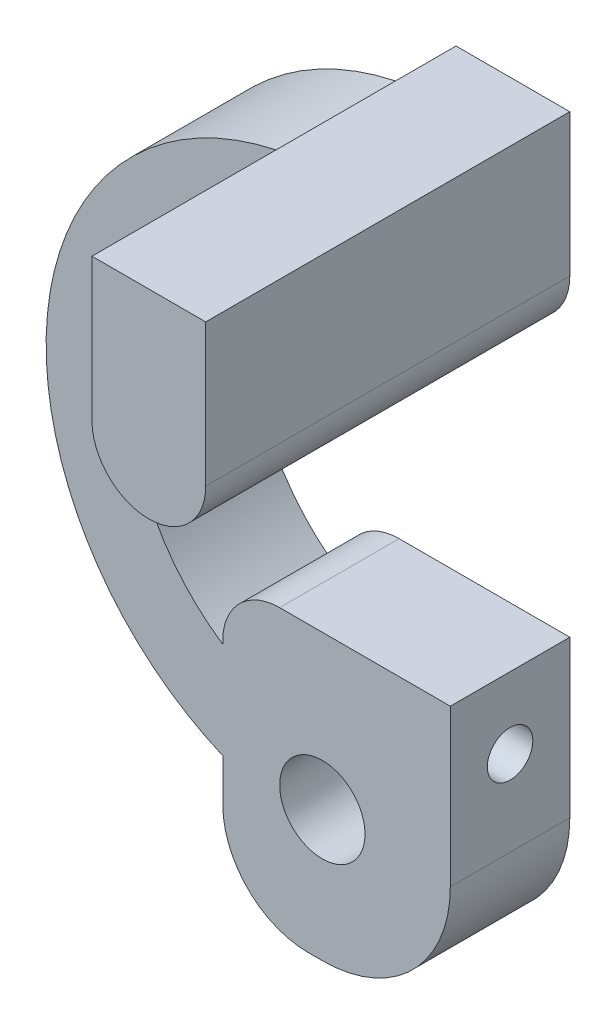
ISO-10303-21;
HEADER;
FILE_DESCRIPTION(('STEP AP214'),'2;1');
FILE_NAME('part.step','',(''),(''),'','','');
FILE_SCHEMA(('AUTOMOTIVE_DESIGN { 1 0 10303 214 1 1 1 1 }'));
ENDSEC;
DATA;
#1=APPLICATION_CONTEXT('core data for automotive mechanical design processes');
#2=APPLICATION_PROTOCOL_DEFINITION('international standard','automotive_design',2000,#1);
#3=PRODUCT_CONTEXT('',#1,'mechanical');
#4=PRODUCT('Part','Part','',(#3));
#5=PRODUCT_RELATED_PRODUCT_CATEGORY('part','',(#4));
#6=PRODUCT_DEFINITION_FORMATION('','',#4);
#7=PRODUCT_DEFINITION_CONTEXT('part definition',#1,'design');
#8=PRODUCT_DEFINITION('design','',#6,#7);
#9=PRODUCT_DEFINITION_SHAPE('','',#8);
#10=(LENGTH_UNIT() NAMED_UNIT(*) SI_UNIT(.MILLI.,.METRE.));
#11=(NAMED_UNIT(*) PLANE_ANGLE_UNIT() SI_UNIT($,.RADIAN.));
#12=(NAMED_UNIT(*) SI_UNIT($,.STERADIAN.) SOLID_ANGLE_UNIT());
#13=UNCERTAINTY_MEASURE_WITH_UNIT(LENGTH_MEASURE(1.E-05),#10,'distance_accuracy_value','');
#14=(GEOMETRIC_REPRESENTATION_CONTEXT(3) GLOBAL_UNCERTAINTY_ASSIGNED_CONTEXT((#13)) GLOBAL_UNIT_ASSIGNED_CONTEXT((#10,
#11,#12)) REPRESENTATION_CONTEXT('',''));
#15=CARTESIAN_POINT('',(0.,0.,0.));
#16=DIRECTION('',(0.,0.,1.));
#17=DIRECTION('',(1.,0.,0.));
#18=AXIS2_PLACEMENT_3D('',#15,#16,#17);
#19=CARTESIAN_POINT('',(0.,0.,4.2));
#20=DIRECTION('',(0.,1.,0.));
#21=DIRECTION('',(0.,0.,1.));
#22=AXIS2_PLACEMENT_3D('',#19,#20,#21);
#23=PLANE('',#22);
#24=DIRECTION('',(1.,0.,0.));
#25=VECTOR('',#24,1.);
#26=CARTESIAN_POINT('',(0.,0.,4.2));
#27=LINE('',#26,#25);
#28=CARTESIAN_POINT('',(3.,0.,4.2));
#29=VERTEX_POINT('',#28);
#30=CARTESIAN_POINT('',(3.5,0.,4.2));
#31=VERTEX_POINT('',#30);
#32=EDGE_CURVE('E177',#29,#31,#27,.T.);
#33=ORIENTED_EDGE('',*,*,#32,.F.);
#34=DIRECTION('',(0.,0.,-1.));
#35=VECTOR('',#34,1.);
#36=CARTESIAN_POINT('',(3.,0.,0.));
#37=LINE('',#36,#35);
#38=CARTESIAN_POINT('',(3.,0.,0.));
#39=VERTEX_POINT('',#38);
#40=EDGE_CURVE('E287',#29,#39,#37,.T.);
#41=ORIENTED_EDGE('',*,*,#40,.T.);
#42=DIRECTION('',(1.,0.,0.));
#43=VECTOR('',#42,1.);
#44=CARTESIAN_POINT('',(0.,0.,0.));
#45=LINE('',#44,#43);
#46=CARTESIAN_POINT('',(3.5,0.,0.));
#47=VERTEX_POINT('',#46);
#48=EDGE_CURVE('E176',#39,#47,#45,.T.);
#49=ORIENTED_EDGE('',*,*,#48,.T.);
#50=DIRECTION('',(0.,0.,-1.));
#51=VECTOR('',#50,1.);
#52=CARTESIAN_POINT('',(3.5,0.,4.2));
#53=LINE('',#52,#51);
#54=EDGE_CURVE('E259',#47,#31,#53,.F.);
#55=ORIENTED_EDGE('',*,*,#54,.T.);
#56=EDGE_LOOP('',(#33,#41,#49,#55));
#57=FACE_BOUND('',#56,.T.);
#58=ADVANCED_FACE('F35',(#57),#23,.F.);
#59=CARTESIAN_POINT('',(8.,0.,4.2));
#60=DIRECTION('',(-1.,0.,0.));
#61=DIRECTION('',(0.,0.,1.));
#62=AXIS2_PLACEMENT_3D('',#59,#60,#61);
#63=PLANE('',#62);
#64=CARTESIAN_POINT('',(8.,7.5,2.1));
#65=DIRECTION('',(1.,0.,0.));
#66=DIRECTION('',(0.,0.,-1.));
#67=AXIS2_PLACEMENT_3D('',#64,#65,#66);
#68=CIRCLE('',#67,0.79999999999999);
#69=CARTESIAN_POINT('',(8.,7.5,1.30000000000001));
#70=VERTEX_POINT('',#69);
#71=EDGE_CURVE('E157',#70,#70,#68,.T.);
#72=ORIENTED_EDGE('',*,*,#71,.F.);
#73=EDGE_LOOP('',(#72));
#74=FACE_BOUND('',#73,.T.);
#75=DIRECTION('',(0.,1.,0.));
#76=VECTOR('',#75,1.);
#77=CARTESIAN_POINT('',(8.,0.,4.2));
#78=LINE('',#77,#76);
#79=CARTESIAN_POINT('',(8.,4.5,4.2));
#80=VERTEX_POINT('',#79);
#81=CARTESIAN_POINT('',(8.,10.,4.2));
#82=VERTEX_POINT('',#81);
#83=EDGE_CURVE('E179',#80,#82,#78,.T.);
#84=ORIENTED_EDGE('',*,*,#83,.F.);
#85=DIRECTION('',(0.,0.,-1.));
#86=VECTOR('',#85,1.);
#87=CARTESIAN_POINT('',(8.,4.5,4.2));
#88=LINE('',#87,#86);
#89=CARTESIAN_POINT('',(8.,4.5,0.));
#90=VERTEX_POINT('',#89);
#91=EDGE_CURVE('E238',#80,#90,#88,.T.);
#92=ORIENTED_EDGE('',*,*,#91,.T.);
#93=DIRECTION('',(0.,1.,0.));
#94=VECTOR('',#93,1.);
#95=CARTESIAN_POINT('',(8.,0.,0.));
#96=LINE('',#95,#94);
#97=CARTESIAN_POINT('',(8.,10.,0.));
#98=VERTEX_POINT('',#97);
#99=EDGE_CURVE('E194',#90,#98,#96,.T.);
#100=ORIENTED_EDGE('',*,*,#99,.T.);
#101=DIRECTION('',(0.,0.,-1.));
#102=VECTOR('',#101,1.);
#103=CARTESIAN_POINT('',(8.,10.,4.2));
#104=LINE('',#103,#102);
#105=EDGE_CURVE('E230',#82,#98,#104,.T.);
#106=ORIENTED_EDGE('',*,*,#105,.F.);
#107=EDGE_LOOP('',(#84,#92,#100,#106));
#108=FACE_BOUND('',#107,.T.);
#109=ADVANCED_FACE('F309',(#74,#108),#63,.F.);
#110=CARTESIAN_POINT('',(0.,10.,4.2));
#111=DIRECTION('',(0.,-1.,0.));
#112=DIRECTION('',(1.,0.,0.));
#113=AXIS2_PLACEMENT_3D('',#110,#111,#112);
#114=PLANE('',#113);
#115=DIRECTION('',(-1.,0.,0.));
#116=VECTOR('',#115,1.);
#117=CARTESIAN_POINT('',(0.,10.,0.));
#118=LINE('',#117,#116);
#119=CARTESIAN_POINT('',(2.,10.,0.));
#120=VERTEX_POINT('',#119);
#121=EDGE_CURVE('E196',#98,#120,#118,.T.);
#122=ORIENTED_EDGE('',*,*,#121,.T.);
#123=DIRECTION('',(0.,0.,-1.));
#124=VECTOR('',#123,1.);
#125=CARTESIAN_POINT('',(2.,10.,4.2));
#126=LINE('',#125,#124);
#127=CARTESIAN_POINT('',(2.,10.,4.2));
#128=VERTEX_POINT('',#127);
#129=EDGE_CURVE('E271',#120,#128,#126,.F.);
#130=ORIENTED_EDGE('',*,*,#129,.T.);
#131=DIRECTION('',(-1.,0.,0.));
#132=VECTOR('',#131,1.);
#133=CARTESIAN_POINT('',(0.,10.,4.2));
#134=LINE('',#133,#132);
#135=EDGE_CURVE('E182',#82,#128,#134,.T.);
#136=ORIENTED_EDGE('',*,*,#135,.F.);
#137=ORIENTED_EDGE('',*,*,#105,.T.);
#138=EDGE_LOOP('',(#122,#130,#136,#137));
#139=FACE_BOUND('',#138,.T.);
#140=ADVANCED_FACE('F312',(#139),#114,.F.);
#141=CARTESIAN_POINT('',(0.,0.,4.2));
#142=DIRECTION('',(-1.,0.,0.));
#143=DIRECTION('',(0.,0.,1.));
#144=AXIS2_PLACEMENT_3D('',#141,#142,#143);
#145=PLANE('',#144);
#146=DIRECTION('',(0.,1.,0.));
#147=VECTOR('',#146,1.);
#148=CARTESIAN_POINT('',(0.,0.,4.2));
#149=LINE('',#148,#147);
#150=CARTESIAN_POINT('',(0.,7.88504763568032,4.2));
#151=VERTEX_POINT('',#150);
#152=CARTESIAN_POINT('',(0.,8.,4.2));
#153=VERTEX_POINT('',#152);
#154=EDGE_CURVE('E185',#151,#153,#149,.T.);
#155=ORIENTED_EDGE('',*,*,#154,.T.);
#156=DIRECTION('',(0.,0.,-1.));
#157=VECTOR('',#156,1.);
#158=CARTESIAN_POINT('',(0.,8.,0.));
#159=LINE('',#158,#157);
#160=CARTESIAN_POINT('',(0.,8.,0.));
#161=VERTEX_POINT('',#160);
#162=EDGE_CURVE('E264',#153,#161,#159,.T.);
#163=ORIENTED_EDGE('',*,*,#162,.T.);
#164=DIRECTION('',(0.,1.,0.));
#165=VECTOR('',#164,1.);
#166=CARTESIAN_POINT('',(0.,0.,0.));
#167=LINE('',#166,#165);
#168=CARTESIAN_POINT('',(0.,7.88504763568032,0.));
#169=VERTEX_POINT('',#168);
#170=EDGE_CURVE('E199',#169,#161,#167,.T.);
#171=ORIENTED_EDGE('',*,*,#170,.F.);
#172=DIRECTION('',(0.,0.,-1.));
#173=VECTOR('',#172,1.);
#174=CARTESIAN_POINT('',(0.,7.88504763568032,4.2));
#175=LINE('',#174,#173);
#176=EDGE_CURVE('E228',#151,#169,#175,.T.);
#177=ORIENTED_EDGE('',*,*,#176,.F.);
#178=EDGE_LOOP('',(#155,#163,#171,#177));
#179=FACE_BOUND('',#178,.T.);
#180=ADVANCED_FACE('F321',(#179),#145,.T.);
#181=CARTESIAN_POINT('',(4.,13.885510766967,4.2));
#182=DIRECTION('',(0.,0.,-1.));
#183=DIRECTION('',(-1.,0.,0.));
#184=AXIS2_PLACEMENT_3D('',#181,#182,#183);
#185=CYLINDRICAL_SURFACE('',#184,7.21148790402723);
#186=CARTESIAN_POINT('',(4.,13.885510766967,0.));
#187=DIRECTION('',(0.,0.,1.));
#188=DIRECTION('',(1.,0.,0.));
#189=AXIS2_PLACEMENT_3D('',#186,#187,#188);
#190=CIRCLE('',#189,7.21148790402723);
#191=CARTESIAN_POINT('',(4.,21.0969986709942,0.));
#192=VERTEX_POINT('',#191);
#193=EDGE_CURVE('E202',#192,#169,#190,.T.);
#194=ORIENTED_EDGE('',*,*,#193,.F.);
#195=DIRECTION('',(0.,0.,-1.));
#196=VECTOR('',#195,1.);
#197=CARTESIAN_POINT('',(4.,21.0969986709942,4.2));
#198=LINE('',#197,#196);
#199=CARTESIAN_POINT('',(4.,21.0969986709942,4.2));
#200=VERTEX_POINT('',#199);
#201=EDGE_CURVE('E227',#200,#192,#198,.T.);
#202=ORIENTED_EDGE('',*,*,#201,.F.);
#203=CARTESIAN_POINT('',(4.,13.885510766967,4.2));
#204=DIRECTION('',(0.,0.,1.));
#205=DIRECTION('',(1.,0.,0.));
#206=AXIS2_PLACEMENT_3D('',#203,#204,#205);
#207=CIRCLE('',#206,7.21148790402723);
#208=EDGE_CURVE('E188',#200,#151,#207,.T.);
#209=ORIENTED_EDGE('',*,*,#208,.T.);
#210=ORIENTED_EDGE('',*,*,#176,.T.);
#211=EDGE_LOOP('',(#194,#202,#209,#210));
#212=FACE_BOUND('',#211,.T.);
#213=ADVANCED_FACE('F325',(#212),#185,.F.);
#214=CARTESIAN_POINT('',(8.,0.,4.2));
#215=DIRECTION('',(-1.,0.,0.));
#216=DIRECTION('',(0.,0.,1.));
#217=AXIS2_PLACEMENT_3D('',#214,#215,#216);
#218=PLANE('',#217);
#219=DIRECTION('',(0.,1.,0.));
#220=VECTOR('',#219,1.);
#221=CARTESIAN_POINT('',(8.,26.,12.8));
#222=LINE('',#221,#220);
#223=CARTESIAN_POINT('',(8.,21.,12.8));
#224=VERTEX_POINT('',#223);
#225=CARTESIAN_POINT('',(8.,26.,12.8));
#226=VERTEX_POINT('',#225);
#227=EDGE_CURVE('E171',#224,#226,#222,.T.);
#228=ORIENTED_EDGE('',*,*,#227,.F.);
#229=DIRECTION('',(0.,0.,-1.));
#230=VECTOR('',#229,1.);
#231=CARTESIAN_POINT('',(8.,21.,0.));
#232=LINE('',#231,#230);
#233=CARTESIAN_POINT('',(8.,21.,0.));
#234=VERTEX_POINT('',#233);
#235=EDGE_CURVE('E275',#224,#234,#232,.T.);
#236=ORIENTED_EDGE('',*,*,#235,.T.);
#237=DIRECTION('',(0.,1.,0.));
#238=VECTOR('',#237,1.);
#239=CARTESIAN_POINT('',(8.,0.,0.));
#240=LINE('',#239,#238);
#241=CARTESIAN_POINT('',(8.,26.,0.));
#242=VERTEX_POINT('',#241);
#243=EDGE_CURVE('E208',#234,#242,#240,.T.);
#244=ORIENTED_EDGE('',*,*,#243,.T.);
#245=DIRECTION('',(0.,0.,-1.));
#246=VECTOR('',#245,1.);
#247=CARTESIAN_POINT('',(8.,26.,4.2));
#248=LINE('',#247,#246);
#249=EDGE_CURVE('E224',#226,#242,#248,.T.);
#250=ORIENTED_EDGE('',*,*,#249,.F.);
#251=EDGE_LOOP('',(#228,#236,#244,#250));
#252=FACE_BOUND('',#251,.T.);
#253=ADVANCED_FACE('F372',(#252),#218,.F.);
#254=CARTESIAN_POINT('',(0.,26.,4.2));
#255=DIRECTION('',(0.,1.,0.));
#256=DIRECTION('',(0.,0.,1.));
#257=AXIS2_PLACEMENT_3D('',#254,#255,#256);
#258=PLANE('',#257);
#259=DIRECTION('',(1.,0.,0.));
#260=VECTOR('',#259,1.);
#261=CARTESIAN_POINT('',(0.,26.,0.));
#262=LINE('',#261,#260);
#263=CARTESIAN_POINT('',(4.,26.,0.));
#264=VERTEX_POINT('',#263);
#265=EDGE_CURVE('E210',#264,#242,#262,.T.);
#266=ORIENTED_EDGE('',*,*,#265,.F.);
#267=DIRECTION('',(0.,0.,-1.));
#268=VECTOR('',#267,1.);
#269=CARTESIAN_POINT('',(4.,26.,4.2));
#270=LINE('',#269,#268);
#271=CARTESIAN_POINT('',(4.,26.,12.8));
#272=VERTEX_POINT('',#271);
#273=EDGE_CURVE('E222',#272,#264,#270,.T.);
#274=ORIENTED_EDGE('',*,*,#273,.F.);
#275=DIRECTION('',(-1.,0.,0.));
#276=VECTOR('',#275,1.);
#277=CARTESIAN_POINT('',(4.,26.,12.8));
#278=LINE('',#277,#276);
#279=EDGE_CURVE('E173',#226,#272,#278,.T.);
#280=ORIENTED_EDGE('',*,*,#279,.F.);
#281=ORIENTED_EDGE('',*,*,#249,.T.);
#282=EDGE_LOOP('',(#266,#274,#280,#281));
#283=FACE_BOUND('',#282,.T.);
#284=ADVANCED_FACE('F377',(#283),#258,.T.);
#285=CARTESIAN_POINT('',(4.00000000000001,0.,4.2));
#286=DIRECTION('',(1.,0.,0.));
#287=DIRECTION('',(0.,1.,0.));
#288=AXIS2_PLACEMENT_3D('',#285,#286,#287);
#289=PLANE('',#288);
#290=DIRECTION('',(0.,-1.,0.));
#291=VECTOR('',#290,1.);
#292=CARTESIAN_POINT('',(4.,0.,0.));
#293=LINE('',#292,#291);
#294=CARTESIAN_POINT('',(4.,21.,0.));
#295=VERTEX_POINT('',#294);
#296=EDGE_CURVE('E205',#192,#295,#293,.T.);
#297=ORIENTED_EDGE('',*,*,#296,.T.);
#298=DIRECTION('',(0.,0.,-1.));
#299=VECTOR('',#298,1.);
#300=CARTESIAN_POINT('',(4.,21.,12.8));
#301=LINE('',#300,#299);
#302=CARTESIAN_POINT('',(4.,21.,12.8));
#303=VERTEX_POINT('',#302);
#304=EDGE_CURVE('E286',#295,#303,#301,.F.);
#305=ORIENTED_EDGE('',*,*,#304,.T.);
#306=DIRECTION('',(0.,-1.,0.));
#307=VECTOR('',#306,1.);
#308=CARTESIAN_POINT('',(4.,26.,12.8));
#309=LINE('',#308,#307);
#310=EDGE_CURVE('E168',#272,#303,#309,.T.);
#311=ORIENTED_EDGE('',*,*,#310,.F.);
#312=ORIENTED_EDGE('',*,*,#273,.T.);
#313=DIRECTION('',(0.,-1.,0.));
#314=VECTOR('',#313,1.);
#315=CARTESIAN_POINT('',(4.00000000000001,0.,0.));
#316=LINE('',#315,#314);
#317=CARTESIAN_POINT('',(4.,24.0969986709942,0.));
#318=VERTEX_POINT('',#317);
#319=EDGE_CURVE('E213',#264,#318,#316,.T.);
#320=ORIENTED_EDGE('',*,*,#319,.T.);
#321=DIRECTION('',(0.,0.,-1.));
#322=VECTOR('',#321,1.);
#323=CARTESIAN_POINT('',(4.,24.0969986709942,4.2));
#324=LINE('',#323,#322);
#325=CARTESIAN_POINT('',(4.,24.0969986709942,4.2));
#326=VERTEX_POINT('',#325);
#327=EDGE_CURVE('E221',#326,#318,#324,.T.);
#328=ORIENTED_EDGE('',*,*,#327,.F.);
#329=DIRECTION('',(0.,-1.,0.));
#330=VECTOR('',#329,1.);
#331=CARTESIAN_POINT('',(4.,26.,4.2));
#332=LINE('',#331,#330);
#333=EDGE_CURVE('E233',#326,#200,#332,.T.);
#334=ORIENTED_EDGE('',*,*,#333,.T.);
#335=ORIENTED_EDGE('',*,*,#201,.T.);
#336=EDGE_LOOP('',(#297,#305,#311,#312,#320,#328,#334,#335));
#337=FACE_BOUND('',#336,.T.);
#338=ADVANCED_FACE('F329',(#337),#289,.F.);
#339=CARTESIAN_POINT('',(4.,13.885510766967,4.2));
#340=DIRECTION('',(0.,0.,-1.));
#341=DIRECTION('',(-1.,0.,0.));
#342=AXIS2_PLACEMENT_3D('',#339,#340,#341);
#343=CYLINDRICAL_SURFACE('',#342,10.2114879040272);
#344=CARTESIAN_POINT('',(4.,13.885510766967,0.));
#345=DIRECTION('',(0.,0.,1.));
#346=DIRECTION('',(1.,0.,0.));
#347=AXIS2_PLACEMENT_3D('',#344,#345,#346);
#348=CIRCLE('',#347,10.2114879040272);
#349=CARTESIAN_POINT('',(0.,4.49006052687238,0.));
#350=VERTEX_POINT('',#349);
#351=EDGE_CURVE('E215',#318,#350,#348,.T.);
#352=ORIENTED_EDGE('',*,*,#351,.T.);
#353=DIRECTION('',(0.,0.,-1.));
#354=VECTOR('',#353,1.);
#355=CARTESIAN_POINT('',(0.,4.49006052687238,4.2));
#356=LINE('',#355,#354);
#357=CARTESIAN_POINT('',(0.,4.49006052687238,4.2));
#358=VERTEX_POINT('',#357);
#359=EDGE_CURVE('E191',#358,#350,#356,.T.);
#360=ORIENTED_EDGE('',*,*,#359,.F.);
#361=CARTESIAN_POINT('',(4.,13.885510766967,4.2));
#362=DIRECTION('',(0.,0.,1.));
#363=DIRECTION('',(1.,0.,0.));
#364=AXIS2_PLACEMENT_3D('',#361,#362,#363);
#365=CIRCLE('',#364,10.2114879040272);
#366=EDGE_CURVE('E192',#326,#358,#365,.T.);
#367=ORIENTED_EDGE('',*,*,#366,.F.);
#368=ORIENTED_EDGE('',*,*,#327,.T.);
#369=EDGE_LOOP('',(#352,#360,#367,#368));
#370=FACE_BOUND('',#369,.T.);
#371=ADVANCED_FACE('F335',(#370),#343,.T.);
#372=CARTESIAN_POINT('',(0.,0.,4.2));
#373=DIRECTION('',(-1.,0.,0.));
#374=DIRECTION('',(0.,0.,1.));
#375=AXIS2_PLACEMENT_3D('',#372,#373,#374);
#376=PLANE('',#375);
#377=DIRECTION('',(0.,1.,0.));
#378=VECTOR('',#377,1.);
#379=CARTESIAN_POINT('',(0.,0.,0.));
#380=LINE('',#379,#378);
#381=CARTESIAN_POINT('',(0.,3.,0.));
#382=VERTEX_POINT('',#381);
#383=EDGE_CURVE('E180',#382,#350,#380,.T.);
#384=ORIENTED_EDGE('',*,*,#383,.F.);
#385=DIRECTION('',(0.,0.,-1.));
#386=VECTOR('',#385,1.);
#387=CARTESIAN_POINT('',(0.,3.,4.2));
#388=LINE('',#387,#386);
#389=CARTESIAN_POINT('',(0.,3.,4.2));
#390=VERTEX_POINT('',#389);
#391=EDGE_CURVE('E43',#382,#390,#388,.F.);
#392=ORIENTED_EDGE('',*,*,#391,.T.);
#393=DIRECTION('',(0.,1.,0.));
#394=VECTOR('',#393,1.);
#395=CARTESIAN_POINT('',(0.,0.,4.2));
#396=LINE('',#395,#394);
#397=EDGE_CURVE('E189',#390,#358,#396,.T.);
#398=ORIENTED_EDGE('',*,*,#397,.T.);
#399=ORIENTED_EDGE('',*,*,#359,.T.);
#400=EDGE_LOOP('',(#384,#392,#398,#399));
#401=FACE_BOUND('',#400,.T.);
#402=ADVANCED_FACE('F379',(#401),#376,.T.);
#403=CARTESIAN_POINT('',(0.,0.,4.2));
#404=DIRECTION('',(0.,0.,1.));
#405=DIRECTION('',(1.,0.,0.));
#406=AXIS2_PLACEMENT_3D('',#403,#404,#405);
#407=PLANE('',#406);
#408=CARTESIAN_POINT('',(3.5,4.6,4.2));
#409=DIRECTION('',(0.,0.,1.));
#410=DIRECTION('',(1.,0.,0.));
#411=AXIS2_PLACEMENT_3D('',#408,#409,#410);
#412=CIRCLE('',#411,1.50000000000001);
#413=CARTESIAN_POINT('',(5.00000000000001,4.6,4.2));
#414=VERTEX_POINT('',#413);
#415=EDGE_CURVE('E160',#414,#414,#412,.T.);
#416=ORIENTED_EDGE('',*,*,#415,.F.);
#417=EDGE_LOOP('',(#416));
#418=FACE_BOUND('',#417,.T.);
#419=ORIENTED_EDGE('',*,*,#397,.F.);
#420=CARTESIAN_POINT('',(3.,3.,4.2));
#421=DIRECTION('',(0.,0.,1.));
#422=DIRECTION('',(1.,0.,0.));
#423=AXIS2_PLACEMENT_3D('',#420,#421,#422);
#424=CIRCLE('',#423,3.);
#425=EDGE_CURVE('E11',#390,#29,#424,.T.);
#426=ORIENTED_EDGE('',*,*,#425,.T.);
#427=ORIENTED_EDGE('',*,*,#32,.T.);
#428=CARTESIAN_POINT('',(3.5,4.5,4.2));
#429=DIRECTION('',(0.,0.,1.));
#430=DIRECTION('',(1.,0.,0.));
#431=AXIS2_PLACEMENT_3D('',#428,#429,#430);
#432=CIRCLE('',#431,4.5);
#433=EDGE_CURVE('E262',#31,#80,#432,.T.);
#434=ORIENTED_EDGE('',*,*,#433,.T.);
#435=ORIENTED_EDGE('',*,*,#83,.T.);
#436=ORIENTED_EDGE('',*,*,#135,.T.);
#437=CARTESIAN_POINT('',(2.,8.,4.2));
#438=DIRECTION('',(0.,0.,1.));
#439=DIRECTION('',(1.,0.,0.));
#440=AXIS2_PLACEMENT_3D('',#437,#438,#439);
#441=CIRCLE('',#440,2.);
#442=EDGE_CURVE('E273',#128,#153,#441,.T.);
#443=ORIENTED_EDGE('',*,*,#442,.T.);
#444=ORIENTED_EDGE('',*,*,#154,.F.);
#445=ORIENTED_EDGE('',*,*,#208,.F.);
#446=ORIENTED_EDGE('',*,*,#333,.F.);
#447=ORIENTED_EDGE('',*,*,#366,.T.);
#448=EDGE_LOOP('',(#419,#426,#427,#434,#435,#436,#443,#444,#445,#446,#447));
#449=FACE_BOUND('',#448,.T.);
#450=ADVANCED_FACE('F306',(#418,#449),#407,.T.);
#451=CARTESIAN_POINT('',(0.,0.,0.));
#452=DIRECTION('',(0.,0.,1.));
#453=DIRECTION('',(1.,0.,0.));
#454=AXIS2_PLACEMENT_3D('',#451,#452,#453);
#455=PLANE('',#454);
#456=CARTESIAN_POINT('',(3.5,4.6,0.));
#457=DIRECTION('',(0.,0.,1.));
#458=DIRECTION('',(1.,0.,0.));
#459=AXIS2_PLACEMENT_3D('',#456,#457,#458);
#460=CIRCLE('',#459,1.50000000000001);
#461=CARTESIAN_POINT('',(5.00000000000001,4.6,0.));
#462=VERTEX_POINT('',#461);
#463=EDGE_CURVE('E167',#462,#462,#460,.T.);
#464=ORIENTED_EDGE('',*,*,#463,.T.);
#465=EDGE_LOOP('',(#464));
#466=FACE_BOUND('',#465,.T.);
#467=ORIENTED_EDGE('',*,*,#48,.F.);
#468=CARTESIAN_POINT('',(3.,3.,0.));
#469=DIRECTION('',(0.,0.,1.));
#470=DIRECTION('',(1.,0.,0.));
#471=AXIS2_PLACEMENT_3D('',#468,#469,#470);
#472=CIRCLE('',#471,3.);
#473=EDGE_CURVE('E57',#39,#382,#472,.F.);
#474=ORIENTED_EDGE('',*,*,#473,.T.);
#475=ORIENTED_EDGE('',*,*,#383,.T.);
#476=ORIENTED_EDGE('',*,*,#351,.F.);
#477=ORIENTED_EDGE('',*,*,#319,.F.);
#478=ORIENTED_EDGE('',*,*,#265,.T.);
#479=ORIENTED_EDGE('',*,*,#243,.F.);
#480=CARTESIAN_POINT('',(6.,21.,0.));
#481=DIRECTION('',(0.,0.,1.));
#482=DIRECTION('',(1.,0.,0.));
#483=AXIS2_PLACEMENT_3D('',#480,#481,#482);
#484=CIRCLE('',#483,2.);
#485=CARTESIAN_POINT('',(6.,19.,0.));
#486=VERTEX_POINT('',#485);
#487=EDGE_CURVE('E280',#234,#486,#484,.F.);
#488=ORIENTED_EDGE('',*,*,#487,.T.);
#489=CARTESIAN_POINT('',(6.,21.,0.));
#490=DIRECTION('',(0.,0.,1.));
#491=DIRECTION('',(1.,0.,0.));
#492=AXIS2_PLACEMENT_3D('',#489,#490,#491);
#493=CIRCLE('',#492,2.);
#494=EDGE_CURVE('E278',#486,#295,#493,.F.);
#495=ORIENTED_EDGE('',*,*,#494,.T.);
#496=ORIENTED_EDGE('',*,*,#296,.F.);
#497=ORIENTED_EDGE('',*,*,#193,.T.);
#498=ORIENTED_EDGE('',*,*,#170,.T.);
#499=CARTESIAN_POINT('',(2.,8.,0.));
#500=DIRECTION('',(0.,0.,1.));
#501=DIRECTION('',(1.,0.,0.));
#502=AXIS2_PLACEMENT_3D('',#499,#500,#501);
#503=CIRCLE('',#502,2.);
#504=EDGE_CURVE('E269',#161,#120,#503,.F.);
#505=ORIENTED_EDGE('',*,*,#504,.T.);
#506=ORIENTED_EDGE('',*,*,#121,.F.);
#507=ORIENTED_EDGE('',*,*,#99,.F.);
#508=CARTESIAN_POINT('',(3.5,4.5,0.));
#509=DIRECTION('',(0.,0.,1.));
#510=DIRECTION('',(1.,0.,0.));
#511=AXIS2_PLACEMENT_3D('',#508,#509,#510);
#512=CIRCLE('',#511,4.5);
#513=EDGE_CURVE('E256',#90,#47,#512,.F.);
#514=ORIENTED_EDGE('',*,*,#513,.T.);
#515=EDGE_LOOP('',(#467,#474,#475,#476,#477,#478,#479,#488,#495,#496,#497,#498,#505,#506,#507,#514));
#516=FACE_BOUND('',#515,.T.);
#517=ADVANCED_FACE('F296',(#466,#516),#455,.F.);
#518=CARTESIAN_POINT('',(0.,0.,12.8));
#519=DIRECTION('',(0.,0.,1.));
#520=DIRECTION('',(1.,0.,0.));
#521=AXIS2_PLACEMENT_3D('',#518,#519,#520);
#522=PLANE('',#521);
#523=CARTESIAN_POINT('',(6.,21.,12.8));
#524=DIRECTION('',(0.,0.,1.));
#525=DIRECTION('',(1.,0.,0.));
#526=AXIS2_PLACEMENT_3D('',#523,#524,#525);
#527=CIRCLE('',#526,2.);
#528=CARTESIAN_POINT('',(6.,19.,12.8));
#529=VERTEX_POINT('',#528);
#530=EDGE_CURVE('E282',#303,#529,#527,.T.);
#531=ORIENTED_EDGE('',*,*,#530,.T.);
#532=CARTESIAN_POINT('',(6.,21.,12.8));
#533=DIRECTION('',(0.,0.,1.));
#534=DIRECTION('',(1.,0.,0.));
#535=AXIS2_PLACEMENT_3D('',#532,#533,#534);
#536=CIRCLE('',#535,2.);
#537=EDGE_CURVE('E284',#529,#224,#536,.T.);
#538=ORIENTED_EDGE('',*,*,#537,.T.);
#539=ORIENTED_EDGE('',*,*,#227,.T.);
#540=ORIENTED_EDGE('',*,*,#279,.T.);
#541=ORIENTED_EDGE('',*,*,#310,.T.);
#542=EDGE_LOOP('',(#531,#538,#539,#540,#541));
#543=FACE_BOUND('',#542,.T.);
#544=ADVANCED_FACE('F356',(#543),#522,.T.);
#545=CARTESIAN_POINT('',(3.5,4.5,4.2));
#546=DIRECTION('',(0.,0.,-1.));
#547=DIRECTION('',(-1.,0.,0.));
#548=AXIS2_PLACEMENT_3D('',#545,#546,#547);
#549=CYLINDRICAL_SURFACE('',#548,4.5);
#550=ORIENTED_EDGE('',*,*,#433,.F.);
#551=ORIENTED_EDGE('',*,*,#54,.F.);
#552=ORIENTED_EDGE('',*,*,#513,.F.);
#553=ORIENTED_EDGE('',*,*,#91,.F.);
#554=EDGE_LOOP('',(#550,#551,#552,#553));
#555=FACE_BOUND('',#554,.T.);
#556=ADVANCED_FACE('F303',(#555),#549,.T.);
#557=CARTESIAN_POINT('',(3.5,4.6,4.2));
#558=DIRECTION('',(0.,0.,1.));
#559=DIRECTION('',(1.,0.,0.));
#560=AXIS2_PLACEMENT_3D('',#557,#558,#559);
#561=CYLINDRICAL_SURFACE('',#560,1.50000000000001);
#562=ORIENTED_EDGE('',*,*,#415,.T.);
#563=EDGE_LOOP('',(#562));
#564=FACE_BOUND('',#563,.T.);
#565=ORIENTED_EDGE('',*,*,#463,.F.);
#566=EDGE_LOOP('',(#565));
#567=FACE_BOUND('',#566,.T.);
#568=ADVANCED_FACE('F355',(#564,#567),#561,.F.);
#569=CARTESIAN_POINT('',(2.,8.,4.2));
#570=DIRECTION('',(0.,0.,1.));
#571=DIRECTION('',(1.,0.,0.));
#572=AXIS2_PLACEMENT_3D('',#569,#570,#571);
#573=CYLINDRICAL_SURFACE('',#572,2.);
#574=ORIENTED_EDGE('',*,*,#442,.F.);
#575=ORIENTED_EDGE('',*,*,#129,.F.);
#576=ORIENTED_EDGE('',*,*,#504,.F.);
#577=ORIENTED_EDGE('',*,*,#162,.F.);
#578=EDGE_LOOP('',(#574,#575,#576,#577));
#579=FACE_BOUND('',#578,.T.);
#580=ADVANCED_FACE('F318',(#579),#573,.T.);
#581=CARTESIAN_POINT('',(6.,21.,4.2));
#582=DIRECTION('',(0.,0.,1.));
#583=DIRECTION('',(1.,0.,0.));
#584=AXIS2_PLACEMENT_3D('',#581,#582,#583);
#585=CYLINDRICAL_SURFACE('',#584,2.);
#586=DIRECTION('',(0.,0.,-1.));
#587=VECTOR('',#586,1.);
#588=CARTESIAN_POINT('',(6.,19.,0.));
#589=LINE('',#588,#587);
#590=EDGE_CURVE('E156',#529,#486,#589,.T.);
#591=ORIENTED_EDGE('',*,*,#590,.F.);
#592=ORIENTED_EDGE('',*,*,#530,.F.);
#593=ORIENTED_EDGE('',*,*,#304,.F.);
#594=ORIENTED_EDGE('',*,*,#494,.F.);
#595=EDGE_LOOP('',(#591,#592,#593,#594));
#596=FACE_BOUND('',#595,.T.);
#597=ADVANCED_FACE('F341',(#596),#585,.T.);
#598=CARTESIAN_POINT('',(6.,21.,4.2));
#599=DIRECTION('',(0.,0.,1.));
#600=DIRECTION('',(1.,0.,0.));
#601=AXIS2_PLACEMENT_3D('',#598,#599,#600);
#602=CYLINDRICAL_SURFACE('',#601,2.);
#603=ORIENTED_EDGE('',*,*,#537,.F.);
#604=ORIENTED_EDGE('',*,*,#590,.T.);
#605=ORIENTED_EDGE('',*,*,#487,.F.);
#606=ORIENTED_EDGE('',*,*,#235,.F.);
#607=EDGE_LOOP('',(#603,#604,#605,#606));
#608=FACE_BOUND('',#607,.T.);
#609=ADVANCED_FACE('F337',(#608),#602,.T.);
#610=CARTESIAN_POINT('',(3.,3.,4.2));
#611=DIRECTION('',(0.,0.,1.));
#612=DIRECTION('',(1.,0.,0.));
#613=AXIS2_PLACEMENT_3D('',#610,#611,#612);
#614=CYLINDRICAL_SURFACE('',#613,3.);
#615=ORIENTED_EDGE('',*,*,#425,.F.);
#616=ORIENTED_EDGE('',*,*,#391,.F.);
#617=ORIENTED_EDGE('',*,*,#473,.F.);
#618=ORIENTED_EDGE('',*,*,#40,.F.);
#619=EDGE_LOOP('',(#615,#616,#617,#618));
#620=FACE_BOUND('',#619,.T.);
#621=ADVANCED_FACE('F37',(#620),#614,.T.);
#622=CARTESIAN_POINT('',(6.02,7.5,2.1));
#623=DIRECTION('',(1.,0.,0.));
#624=DIRECTION('',(0.,0.,-1.));
#625=AXIS2_PLACEMENT_3D('',#622,#623,#624);
#626=CONICAL_SURFACE('',#625,0.799999999999988,1.02974425867664);
#627=CARTESIAN_POINT('',(5.53931150477795,7.5,2.1));
#628=VERTEX_POINT('',#627);
#629=VERTEX_LOOP('',#628);
#630=FACE_BOUND('',#629,.T.);
#631=CARTESIAN_POINT('',(6.02,7.5,2.1));
#632=DIRECTION('',(1.,0.,0.));
#633=DIRECTION('',(0.,0.,-1.));
#634=AXIS2_PLACEMENT_3D('',#631,#632,#633);
#635=CIRCLE('',#634,0.799999999999988);
#636=CARTESIAN_POINT('',(6.02,7.5,1.30000000000001));
#637=VERTEX_POINT('',#636);
#638=EDGE_CURVE('E154',#637,#637,#635,.T.);
#639=ORIENTED_EDGE('',*,*,#638,.T.);
#640=EDGE_LOOP('',(#639));
#641=FACE_BOUND('',#640,.T.);
#642=ADVANCED_FACE('F147',(#630,#641),#626,.F.);
#643=CARTESIAN_POINT('',(8.,7.5,2.1));
#644=DIRECTION('',(1.,0.,0.));
#645=DIRECTION('',(0.,0.,-1.));
#646=AXIS2_PLACEMENT_3D('',#643,#644,#645);
#647=CYLINDRICAL_SURFACE('',#646,0.799999999999989);
#648=ORIENTED_EDGE('',*,*,#638,.F.);
#649=EDGE_LOOP('',(#648));
#650=FACE_BOUND('',#649,.T.);
#651=ORIENTED_EDGE('',*,*,#71,.T.);
#652=EDGE_LOOP('',(#651));
#653=FACE_BOUND('',#652,.T.);
#654=ADVANCED_FACE('F150',(#650,#653),#647,.F.);
#655=CLOSED_SHELL('',(#58,#109,#140,#180,#213,#253,#284,#338,#371,#402,#450,#517,#544,#556,#568,
#580,#597,#609,#621,#642,#654));
#656=MANIFOLD_SOLID_BREP('B2',#655);
#657=ADVANCED_BREP_SHAPE_REPRESENTATION('',(#18,#656),#14);
#658=SHAPE_DEFINITION_REPRESENTATION(#9,#657);
ENDSEC;
END-ISO-10303-21;
